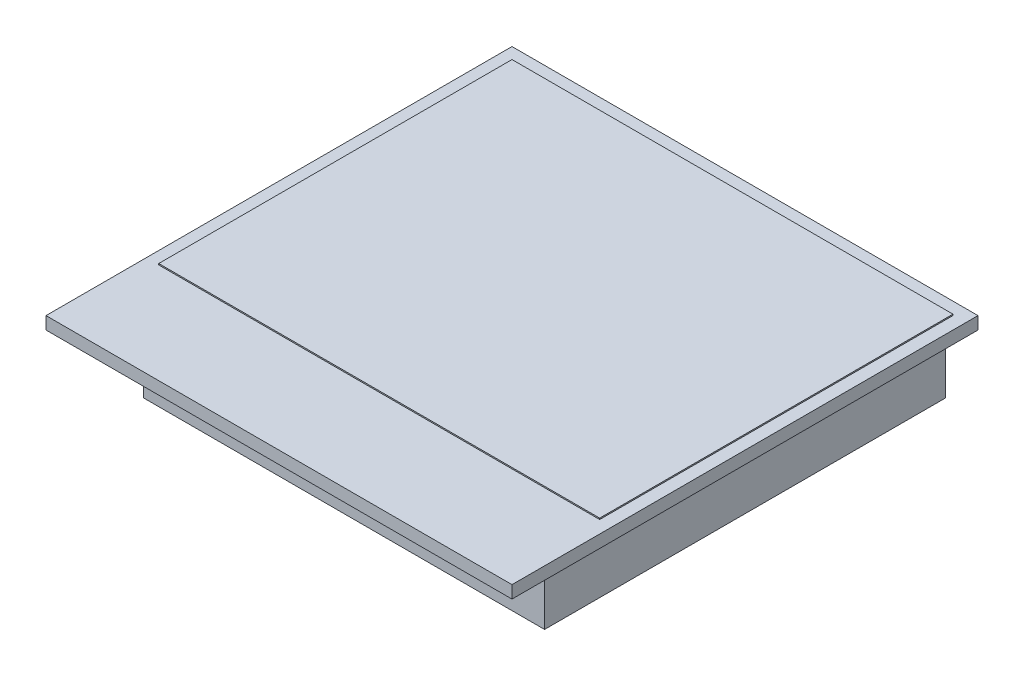
ISO-10303-21;
HEADER;
FILE_DESCRIPTION(('STEP AP214'),'2;1');
FILE_NAME('part.step','',(''),(''),'','','');
FILE_SCHEMA(('AUTOMOTIVE_DESIGN { 1 0 10303 214 1 1 1 1 }'));
ENDSEC;
DATA;
#1=APPLICATION_CONTEXT('core data for automotive mechanical design processes');
#2=APPLICATION_PROTOCOL_DEFINITION('international standard','automotive_design',2000,#1);
#3=PRODUCT_CONTEXT('',#1,'mechanical');
#4=PRODUCT('Part','Part','',(#3));
#5=PRODUCT_RELATED_PRODUCT_CATEGORY('part','',(#4));
#6=PRODUCT_DEFINITION_FORMATION('','',#4);
#7=PRODUCT_DEFINITION_CONTEXT('part definition',#1,'design');
#8=PRODUCT_DEFINITION('design','',#6,#7);
#9=PRODUCT_DEFINITION_SHAPE('','',#8);
#10=(LENGTH_UNIT() NAMED_UNIT(*) SI_UNIT(.MILLI.,.METRE.));
#11=(NAMED_UNIT(*) PLANE_ANGLE_UNIT() SI_UNIT($,.RADIAN.));
#12=(NAMED_UNIT(*) SI_UNIT($,.STERADIAN.) SOLID_ANGLE_UNIT());
#13=UNCERTAINTY_MEASURE_WITH_UNIT(LENGTH_MEASURE(1.E-05),#10,'distance_accuracy_value','');
#14=(GEOMETRIC_REPRESENTATION_CONTEXT(3) GLOBAL_UNCERTAINTY_ASSIGNED_CONTEXT((#13)) GLOBAL_UNIT_ASSIGNED_CONTEXT((#10,
#11,#12)) REPRESENTATION_CONTEXT('',''));
#15=CARTESIAN_POINT('',(0.,0.,0.));
#16=DIRECTION('',(0.,0.,1.));
#17=DIRECTION('',(1.,0.,0.));
#18=AXIS2_PLACEMENT_3D('',#15,#16,#17);
#19=CARTESIAN_POINT('',(-8.,-3.,-2.60000000000001));
#20=DIRECTION('',(1.,0.,0.));
#21=DIRECTION('',(0.,0.,-1.));
#22=AXIS2_PLACEMENT_3D('',#19,#20,#21);
#23=PLANE('',#22);
#24=DIRECTION('',(0.,0.,-1.));
#25=VECTOR('',#24,1.);
#26=CARTESIAN_POINT('',(-8.,0.,-2.60000000000001));
#27=LINE('',#26,#25);
#28=CARTESIAN_POINT('',(-8.,0.,-2.60000000000001));
#29=VERTEX_POINT('',#28);
#30=CARTESIAN_POINT('',(-8.,0.,-18.6));
#31=VERTEX_POINT('',#30);
#32=EDGE_CURVE('E110',#29,#31,#27,.T.);
#33=ORIENTED_EDGE('',*,*,#32,.T.);
#34=DIRECTION('',(0.,1.,0.));
#35=VECTOR('',#34,1.);
#36=CARTESIAN_POINT('',(-8.,-3.,-18.6));
#37=LINE('',#36,#35);
#38=CARTESIAN_POINT('',(-8.,-3.,-18.6));
#39=VERTEX_POINT('',#38);
#40=EDGE_CURVE('E12',#39,#31,#37,.T.);
#41=ORIENTED_EDGE('',*,*,#40,.F.);
#42=DIRECTION('',(0.,0.,-1.));
#43=VECTOR('',#42,1.);
#44=CARTESIAN_POINT('',(-8.,-3.,-2.60000000000001));
#45=LINE('',#44,#43);
#46=CARTESIAN_POINT('',(-8.,-3.,-2.60000000000001));
#47=VERTEX_POINT('',#46);
#48=EDGE_CURVE('E98',#47,#39,#45,.T.);
#49=ORIENTED_EDGE('',*,*,#48,.F.);
#50=DIRECTION('',(0.,1.,0.));
#51=VECTOR('',#50,1.);
#52=CARTESIAN_POINT('',(-8.,-3.,-2.60000000000001));
#53=LINE('',#52,#51);
#54=EDGE_CURVE('E106',#47,#29,#53,.T.);
#55=ORIENTED_EDGE('',*,*,#54,.T.);
#56=EDGE_LOOP('',(#33,#41,#49,#55));
#57=FACE_BOUND('',#56,.T.);
#58=ADVANCED_FACE('F47',(#57),#23,.F.);
#59=CARTESIAN_POINT('',(-8.,-3.,-18.6));
#60=DIRECTION('',(0.,0.,1.));
#61=DIRECTION('',(1.,0.,0.));
#62=AXIS2_PLACEMENT_3D('',#59,#60,#61);
#63=PLANE('',#62);
#64=DIRECTION('',(1.,0.,0.));
#65=VECTOR('',#64,1.);
#66=CARTESIAN_POINT('',(-8.,0.,-18.6));
#67=LINE('',#66,#65);
#68=CARTESIAN_POINT('',(8.,0.,-18.6));
#69=VERTEX_POINT('',#68);
#70=EDGE_CURVE('E102',#31,#69,#67,.T.);
#71=ORIENTED_EDGE('',*,*,#70,.T.);
#72=DIRECTION('',(0.,1.,0.));
#73=VECTOR('',#72,1.);
#74=CARTESIAN_POINT('',(8.,-3.,-18.6));
#75=LINE('',#74,#73);
#76=CARTESIAN_POINT('',(8.,-3.,-18.6));
#77=VERTEX_POINT('',#76);
#78=EDGE_CURVE('E55',#77,#69,#75,.T.);
#79=ORIENTED_EDGE('',*,*,#78,.F.);
#80=DIRECTION('',(1.,0.,0.));
#81=VECTOR('',#80,1.);
#82=CARTESIAN_POINT('',(-8.,-3.,-18.6));
#83=LINE('',#82,#81);
#84=EDGE_CURVE('E93',#39,#77,#83,.T.);
#85=ORIENTED_EDGE('',*,*,#84,.F.);
#86=ORIENTED_EDGE('',*,*,#40,.T.);
#87=EDGE_LOOP('',(#71,#79,#85,#86));
#88=FACE_BOUND('',#87,.T.);
#89=ADVANCED_FACE('F101',(#88),#63,.F.);
#90=CARTESIAN_POINT('',(8.,-3.,-2.60000000000001));
#91=DIRECTION('',(-1.,0.,0.));
#92=DIRECTION('',(0.,0.,1.));
#93=AXIS2_PLACEMENT_3D('',#90,#91,#92);
#94=PLANE('',#93);
#95=DIRECTION('',(0.,0.,1.));
#96=VECTOR('',#95,1.);
#97=CARTESIAN_POINT('',(8.,0.,-2.60000000000001));
#98=LINE('',#97,#96);
#99=CARTESIAN_POINT('',(8.,0.,-2.60000000000001));
#100=VERTEX_POINT('',#99);
#101=EDGE_CURVE('E80',#69,#100,#98,.T.);
#102=ORIENTED_EDGE('',*,*,#101,.T.);
#103=DIRECTION('',(0.,1.,0.));
#104=VECTOR('',#103,1.);
#105=CARTESIAN_POINT('',(8.,-3.,-2.60000000000001));
#106=LINE('',#105,#104);
#107=CARTESIAN_POINT('',(8.,-3.,-2.60000000000001));
#108=VERTEX_POINT('',#107);
#109=EDGE_CURVE('E103',#108,#100,#106,.T.);
#110=ORIENTED_EDGE('',*,*,#109,.F.);
#111=DIRECTION('',(0.,0.,1.));
#112=VECTOR('',#111,1.);
#113=CARTESIAN_POINT('',(8.,-3.,-2.60000000000001));
#114=LINE('',#113,#112);
#115=EDGE_CURVE('E96',#77,#108,#114,.T.);
#116=ORIENTED_EDGE('',*,*,#115,.F.);
#117=ORIENTED_EDGE('',*,*,#78,.T.);
#118=EDGE_LOOP('',(#102,#110,#116,#117));
#119=FACE_BOUND('',#118,.T.);
#120=ADVANCED_FACE('F104',(#119),#94,.F.);
#121=CARTESIAN_POINT('',(-8.,-3.,-2.60000000000001));
#122=DIRECTION('',(0.,0.,-1.));
#123=DIRECTION('',(-1.,0.,0.));
#124=AXIS2_PLACEMENT_3D('',#121,#122,#123);
#125=PLANE('',#124);
#126=DIRECTION('',(-1.,0.,0.));
#127=VECTOR('',#126,1.);
#128=CARTESIAN_POINT('',(-8.,0.,-2.60000000000001));
#129=LINE('',#128,#127);
#130=EDGE_CURVE('E86',#100,#29,#129,.T.);
#131=ORIENTED_EDGE('',*,*,#130,.T.);
#132=ORIENTED_EDGE('',*,*,#54,.F.);
#133=DIRECTION('',(-1.,0.,0.));
#134=VECTOR('',#133,1.);
#135=CARTESIAN_POINT('',(-8.,-3.,-2.60000000000001));
#136=LINE('',#135,#134);
#137=EDGE_CURVE('E63',#108,#47,#136,.T.);
#138=ORIENTED_EDGE('',*,*,#137,.F.);
#139=ORIENTED_EDGE('',*,*,#109,.T.);
#140=EDGE_LOOP('',(#131,#132,#138,#139));
#141=FACE_BOUND('',#140,.T.);
#142=ADVANCED_FACE('F117',(#141),#125,.F.);
#143=CARTESIAN_POINT('',(0.,-3.,0.));
#144=DIRECTION('',(0.,-1.,0.));
#145=DIRECTION('',(0.,0.,-1.));
#146=AXIS2_PLACEMENT_3D('',#143,#144,#145);
#147=PLANE('',#146);
#148=ORIENTED_EDGE('',*,*,#48,.T.);
#149=ORIENTED_EDGE('',*,*,#84,.T.);
#150=ORIENTED_EDGE('',*,*,#115,.T.);
#151=ORIENTED_EDGE('',*,*,#137,.T.);
#152=EDGE_LOOP('',(#148,#149,#150,#151));
#153=FACE_BOUND('',#152,.T.);
#154=ADVANCED_FACE('F94',(#153),#147,.T.);
#155=CARTESIAN_POINT('',(0.,0.,0.));
#156=DIRECTION('',(0.,-1.,0.));
#157=DIRECTION('',(0.,0.,-1.));
#158=AXIS2_PLACEMENT_3D('',#155,#156,#157);
#159=PLANE('',#158);
#160=ORIENTED_EDGE('',*,*,#32,.F.);
#161=ORIENTED_EDGE('',*,*,#130,.F.);
#162=ORIENTED_EDGE('',*,*,#101,.F.);
#163=ORIENTED_EDGE('',*,*,#70,.F.);
#164=EDGE_LOOP('',(#160,#161,#162,#163));
#165=FACE_BOUND('',#164,.T.);
#166=ADVANCED_FACE('F120',(#165),#159,.F.);
#167=CLOSED_SHELL('',(#58,#89,#120,#142,#154,#166));
#168=MANIFOLD_SOLID_BREP('B2',#167);
#169=CARTESIAN_POINT('',(-8.8,0.55,-18.1));
#170=DIRECTION('',(1.,0.,0.));
#171=DIRECTION('',(0.,0.,-1.));
#172=AXIS2_PLACEMENT_3D('',#169,#170,#171);
#173=PLANE('',#172);
#174=DIRECTION('',(0.,0.,1.));
#175=VECTOR('',#174,1.);
#176=CARTESIAN_POINT('',(-8.8,0.5,-18.1));
#177=LINE('',#176,#175);
#178=CARTESIAN_POINT('',(-8.8,0.5,-18.1));
#179=VERTEX_POINT('',#178);
#180=CARTESIAN_POINT('',(-8.8,0.5,-4.));
#181=VERTEX_POINT('',#180);
#182=EDGE_CURVE('E242',#179,#181,#177,.T.);
#183=ORIENTED_EDGE('',*,*,#182,.T.);
#184=DIRECTION('',(0.,-1.,0.));
#185=VECTOR('',#184,1.);
#186=CARTESIAN_POINT('',(-8.8,0.55,-4.));
#187=LINE('',#186,#185);
#188=CARTESIAN_POINT('',(-8.8,0.55,-4.));
#189=VERTEX_POINT('',#188);
#190=EDGE_CURVE('E45',#189,#181,#187,.T.);
#191=ORIENTED_EDGE('',*,*,#190,.F.);
#192=DIRECTION('',(0.,0.,1.));
#193=VECTOR('',#192,1.);
#194=CARTESIAN_POINT('',(-8.8,0.55,-18.1));
#195=LINE('',#194,#193);
#196=CARTESIAN_POINT('',(-8.8,0.55,-18.1));
#197=VERTEX_POINT('',#196);
#198=EDGE_CURVE('E230',#197,#189,#195,.T.);
#199=ORIENTED_EDGE('',*,*,#198,.F.);
#200=DIRECTION('',(0.,-1.,0.));
#201=VECTOR('',#200,1.);
#202=CARTESIAN_POINT('',(-8.8,0.55,-18.1));
#203=LINE('',#202,#201);
#204=EDGE_CURVE('E238',#197,#179,#203,.T.);
#205=ORIENTED_EDGE('',*,*,#204,.T.);
#206=EDGE_LOOP('',(#183,#191,#199,#205));
#207=FACE_BOUND('',#206,.T.);
#208=ADVANCED_FACE('F179',(#207),#173,.F.);
#209=CARTESIAN_POINT('',(-8.8,0.55,-4.));
#210=DIRECTION('',(0.,0.,-1.));
#211=DIRECTION('',(-1.,0.,0.));
#212=AXIS2_PLACEMENT_3D('',#209,#210,#211);
#213=PLANE('',#212);
#214=DIRECTION('',(1.,0.,0.));
#215=VECTOR('',#214,1.);
#216=CARTESIAN_POINT('',(-8.8,0.5,-4.));
#217=LINE('',#216,#215);
#218=CARTESIAN_POINT('',(8.8,0.5,-4.));
#219=VERTEX_POINT('',#218);
#220=EDGE_CURVE('E234',#181,#219,#217,.T.);
#221=ORIENTED_EDGE('',*,*,#220,.T.);
#222=DIRECTION('',(0.,-1.,0.));
#223=VECTOR('',#222,1.);
#224=CARTESIAN_POINT('',(8.8,0.55,-4.));
#225=LINE('',#224,#223);
#226=CARTESIAN_POINT('',(8.8,0.55,-4.));
#227=VERTEX_POINT('',#226);
#228=EDGE_CURVE('E187',#227,#219,#225,.T.);
#229=ORIENTED_EDGE('',*,*,#228,.F.);
#230=DIRECTION('',(1.,0.,0.));
#231=VECTOR('',#230,1.);
#232=CARTESIAN_POINT('',(-8.8,0.55,-4.));
#233=LINE('',#232,#231);
#234=EDGE_CURVE('E225',#189,#227,#233,.T.);
#235=ORIENTED_EDGE('',*,*,#234,.F.);
#236=ORIENTED_EDGE('',*,*,#190,.T.);
#237=EDGE_LOOP('',(#221,#229,#235,#236));
#238=FACE_BOUND('',#237,.T.);
#239=ADVANCED_FACE('F233',(#238),#213,.F.);
#240=CARTESIAN_POINT('',(8.8,0.55,-18.1));
#241=DIRECTION('',(-1.,0.,0.));
#242=DIRECTION('',(0.,0.,1.));
#243=AXIS2_PLACEMENT_3D('',#240,#241,#242);
#244=PLANE('',#243);
#245=DIRECTION('',(0.,0.,-1.));
#246=VECTOR('',#245,1.);
#247=CARTESIAN_POINT('',(8.8,0.5,-18.1));
#248=LINE('',#247,#246);
#249=CARTESIAN_POINT('',(8.8,0.5,-18.1));
#250=VERTEX_POINT('',#249);
#251=EDGE_CURVE('E212',#219,#250,#248,.T.);
#252=ORIENTED_EDGE('',*,*,#251,.T.);
#253=DIRECTION('',(0.,-1.,0.));
#254=VECTOR('',#253,1.);
#255=CARTESIAN_POINT('',(8.8,0.55,-18.1));
#256=LINE('',#255,#254);
#257=CARTESIAN_POINT('',(8.8,0.55,-18.1));
#258=VERTEX_POINT('',#257);
#259=EDGE_CURVE('E235',#258,#250,#256,.T.);
#260=ORIENTED_EDGE('',*,*,#259,.F.);
#261=DIRECTION('',(0.,0.,-1.));
#262=VECTOR('',#261,1.);
#263=CARTESIAN_POINT('',(8.8,0.55,-18.1));
#264=LINE('',#263,#262);
#265=EDGE_CURVE('E228',#227,#258,#264,.T.);
#266=ORIENTED_EDGE('',*,*,#265,.F.);
#267=ORIENTED_EDGE('',*,*,#228,.T.);
#268=EDGE_LOOP('',(#252,#260,#266,#267));
#269=FACE_BOUND('',#268,.T.);
#270=ADVANCED_FACE('F236',(#269),#244,.F.);
#271=CARTESIAN_POINT('',(-8.8,0.55,-18.1));
#272=DIRECTION('',(0.,0.,1.));
#273=DIRECTION('',(1.,0.,0.));
#274=AXIS2_PLACEMENT_3D('',#271,#272,#273);
#275=PLANE('',#274);
#276=DIRECTION('',(-1.,0.,0.));
#277=VECTOR('',#276,1.);
#278=CARTESIAN_POINT('',(-8.8,0.5,-18.1));
#279=LINE('',#278,#277);
#280=EDGE_CURVE('E218',#250,#179,#279,.T.);
#281=ORIENTED_EDGE('',*,*,#280,.T.);
#282=ORIENTED_EDGE('',*,*,#204,.F.);
#283=DIRECTION('',(-1.,0.,0.));
#284=VECTOR('',#283,1.);
#285=CARTESIAN_POINT('',(-8.8,0.55,-18.1));
#286=LINE('',#285,#284);
#287=EDGE_CURVE('E195',#258,#197,#286,.T.);
#288=ORIENTED_EDGE('',*,*,#287,.F.);
#289=ORIENTED_EDGE('',*,*,#259,.T.);
#290=EDGE_LOOP('',(#281,#282,#288,#289));
#291=FACE_BOUND('',#290,.T.);
#292=ADVANCED_FACE('F249',(#291),#275,.F.);
#293=CARTESIAN_POINT('',(0.,0.55,0.));
#294=DIRECTION('',(0.,1.,0.));
#295=DIRECTION('',(0.,0.,1.));
#296=AXIS2_PLACEMENT_3D('',#293,#294,#295);
#297=PLANE('',#296);
#298=ORIENTED_EDGE('',*,*,#198,.T.);
#299=ORIENTED_EDGE('',*,*,#234,.T.);
#300=ORIENTED_EDGE('',*,*,#265,.T.);
#301=ORIENTED_EDGE('',*,*,#287,.T.);
#302=EDGE_LOOP('',(#298,#299,#300,#301));
#303=FACE_BOUND('',#302,.T.);
#304=ADVANCED_FACE('F226',(#303),#297,.T.);
#305=CARTESIAN_POINT('',(0.,0.5,0.));
#306=DIRECTION('',(0.,1.,0.));
#307=DIRECTION('',(0.,0.,1.));
#308=AXIS2_PLACEMENT_3D('',#305,#306,#307);
#309=PLANE('',#308);
#310=ORIENTED_EDGE('',*,*,#182,.F.);
#311=ORIENTED_EDGE('',*,*,#280,.F.);
#312=ORIENTED_EDGE('',*,*,#251,.F.);
#313=ORIENTED_EDGE('',*,*,#220,.F.);
#314=EDGE_LOOP('',(#310,#311,#312,#313));
#315=FACE_BOUND('',#314,.T.);
#316=ADVANCED_FACE('F252',(#315),#309,.F.);
#317=CLOSED_SHELL('',(#208,#239,#270,#292,#304,#316));
#318=MANIFOLD_SOLID_BREP('B6',#317);
#319=CARTESIAN_POINT('',(-9.3,0.5,0.));
#320=DIRECTION('',(1.,0.,0.));
#321=DIRECTION('',(0.,0.,-1.));
#322=AXIS2_PLACEMENT_3D('',#319,#320,#321);
#323=PLANE('',#322);
#324=DIRECTION('',(0.,0.,1.));
#325=VECTOR('',#324,1.);
#326=CARTESIAN_POINT('',(-9.3,0.,0.));
#327=LINE('',#326,#325);
#328=CARTESIAN_POINT('',(-9.3,0.,-18.6));
#329=VERTEX_POINT('',#328);
#330=CARTESIAN_POINT('',(-9.3,0.,0.));
#331=VERTEX_POINT('',#330);
#332=EDGE_CURVE('E365',#329,#331,#327,.T.);
#333=ORIENTED_EDGE('',*,*,#332,.T.);
#334=DIRECTION('',(0.,-1.,0.));
#335=VECTOR('',#334,1.);
#336=CARTESIAN_POINT('',(-9.3,0.5,0.));
#337=LINE('',#336,#335);
#338=CARTESIAN_POINT('',(-9.3,0.5,0.));
#339=VERTEX_POINT('',#338);
#340=EDGE_CURVE('E177',#339,#331,#337,.T.);
#341=ORIENTED_EDGE('',*,*,#340,.F.);
#342=DIRECTION('',(0.,0.,1.));
#343=VECTOR('',#342,1.);
#344=CARTESIAN_POINT('',(-9.3,0.5,0.));
#345=LINE('',#344,#343);
#346=CARTESIAN_POINT('',(-9.3,0.5,-18.6));
#347=VERTEX_POINT('',#346);
#348=EDGE_CURVE('E353',#347,#339,#345,.T.);
#349=ORIENTED_EDGE('',*,*,#348,.F.);
#350=DIRECTION('',(0.,-1.,0.));
#351=VECTOR('',#350,1.);
#352=CARTESIAN_POINT('',(-9.3,0.5,-18.6));
#353=LINE('',#352,#351);
#354=EDGE_CURVE('E361',#347,#329,#353,.T.);
#355=ORIENTED_EDGE('',*,*,#354,.T.);
#356=EDGE_LOOP('',(#333,#341,#349,#355));
#357=FACE_BOUND('',#356,.T.);
#358=ADVANCED_FACE('F302',(#357),#323,.F.);
#359=CARTESIAN_POINT('',(-9.3,0.5,0.));
#360=DIRECTION('',(0.,0.,-1.));
#361=DIRECTION('',(-1.,0.,0.));
#362=AXIS2_PLACEMENT_3D('',#359,#360,#361);
#363=PLANE('',#362);
#364=DIRECTION('',(1.,0.,0.));
#365=VECTOR('',#364,1.);
#366=CARTESIAN_POINT('',(-9.3,0.,0.));
#367=LINE('',#366,#365);
#368=CARTESIAN_POINT('',(9.3,0.,0.));
#369=VERTEX_POINT('',#368);
#370=EDGE_CURVE('E357',#331,#369,#367,.T.);
#371=ORIENTED_EDGE('',*,*,#370,.T.);
#372=DIRECTION('',(0.,-1.,0.));
#373=VECTOR('',#372,1.);
#374=CARTESIAN_POINT('',(9.3,0.5,0.));
#375=LINE('',#374,#373);
#376=CARTESIAN_POINT('',(9.3,0.5,0.));
#377=VERTEX_POINT('',#376);
#378=EDGE_CURVE('E310',#377,#369,#375,.T.);
#379=ORIENTED_EDGE('',*,*,#378,.F.);
#380=DIRECTION('',(1.,0.,0.));
#381=VECTOR('',#380,1.);
#382=CARTESIAN_POINT('',(-9.3,0.5,0.));
#383=LINE('',#382,#381);
#384=EDGE_CURVE('E348',#339,#377,#383,.T.);
#385=ORIENTED_EDGE('',*,*,#384,.F.);
#386=ORIENTED_EDGE('',*,*,#340,.T.);
#387=EDGE_LOOP('',(#371,#379,#385,#386));
#388=FACE_BOUND('',#387,.T.);
#389=ADVANCED_FACE('F356',(#388),#363,.F.);
#390=CARTESIAN_POINT('',(9.3,0.5,0.));
#391=DIRECTION('',(-1.,0.,0.));
#392=DIRECTION('',(0.,0.,1.));
#393=AXIS2_PLACEMENT_3D('',#390,#391,#392);
#394=PLANE('',#393);
#395=DIRECTION('',(0.,0.,-1.));
#396=VECTOR('',#395,1.);
#397=CARTESIAN_POINT('',(9.3,0.,0.));
#398=LINE('',#397,#396);
#399=CARTESIAN_POINT('',(9.29999999999999,0.,-18.6));
#400=VERTEX_POINT('',#399);
#401=EDGE_CURVE('E335',#369,#400,#398,.T.);
#402=ORIENTED_EDGE('',*,*,#401,.T.);
#403=DIRECTION('',(0.,-1.,0.));
#404=VECTOR('',#403,1.);
#405=CARTESIAN_POINT('',(9.29999999999999,0.5,-18.6));
#406=LINE('',#405,#404);
#407=CARTESIAN_POINT('',(9.29999999999999,0.5,-18.6));
#408=VERTEX_POINT('',#407);
#409=EDGE_CURVE('E358',#408,#400,#406,.T.);
#410=ORIENTED_EDGE('',*,*,#409,.F.);
#411=DIRECTION('',(0.,0.,-1.));
#412=VECTOR('',#411,1.);
#413=CARTESIAN_POINT('',(9.3,0.5,0.));
#414=LINE('',#413,#412);
#415=EDGE_CURVE('E351',#377,#408,#414,.T.);
#416=ORIENTED_EDGE('',*,*,#415,.F.);
#417=ORIENTED_EDGE('',*,*,#378,.T.);
#418=EDGE_LOOP('',(#402,#410,#416,#417));
#419=FACE_BOUND('',#418,.T.);
#420=ADVANCED_FACE('F359',(#419),#394,.F.);
#421=CARTESIAN_POINT('',(-9.3,0.5,-18.6));
#422=DIRECTION('',(0.,0.,1.));
#423=DIRECTION('',(1.,0.,0.));
#424=AXIS2_PLACEMENT_3D('',#421,#422,#423);
#425=PLANE('',#424);
#426=DIRECTION('',(-1.,0.,0.));
#427=VECTOR('',#426,1.);
#428=CARTESIAN_POINT('',(-9.3,0.,-18.6));
#429=LINE('',#428,#427);
#430=EDGE_CURVE('E341',#400,#329,#429,.T.);
#431=ORIENTED_EDGE('',*,*,#430,.T.);
#432=ORIENTED_EDGE('',*,*,#354,.F.);
#433=DIRECTION('',(-1.,0.,0.));
#434=VECTOR('',#433,1.);
#435=CARTESIAN_POINT('',(-9.3,0.5,-18.6));
#436=LINE('',#435,#434);
#437=EDGE_CURVE('E318',#408,#347,#436,.T.);
#438=ORIENTED_EDGE('',*,*,#437,.F.);
#439=ORIENTED_EDGE('',*,*,#409,.T.);
#440=EDGE_LOOP('',(#431,#432,#438,#439));
#441=FACE_BOUND('',#440,.T.);
#442=ADVANCED_FACE('F372',(#441),#425,.F.);
#443=CARTESIAN_POINT('',(0.,0.5,0.));
#444=DIRECTION('',(0.,-1.,0.));
#445=DIRECTION('',(0.,0.,-1.));
#446=AXIS2_PLACEMENT_3D('',#443,#444,#445);
#447=PLANE('',#446);
#448=ORIENTED_EDGE('',*,*,#348,.T.);
#449=ORIENTED_EDGE('',*,*,#384,.T.);
#450=ORIENTED_EDGE('',*,*,#415,.T.);
#451=ORIENTED_EDGE('',*,*,#437,.T.);
#452=EDGE_LOOP('',(#448,#449,#450,#451));
#453=FACE_BOUND('',#452,.T.);
#454=ADVANCED_FACE('F349',(#453),#447,.F.);
#455=CARTESIAN_POINT('',(0.,0.,0.));
#456=DIRECTION('',(0.,-1.,0.));
#457=DIRECTION('',(0.,0.,-1.));
#458=AXIS2_PLACEMENT_3D('',#455,#456,#457);
#459=PLANE('',#458);
#460=ORIENTED_EDGE('',*,*,#332,.F.);
#461=ORIENTED_EDGE('',*,*,#430,.F.);
#462=ORIENTED_EDGE('',*,*,#401,.F.);
#463=ORIENTED_EDGE('',*,*,#370,.F.);
#464=EDGE_LOOP('',(#460,#461,#462,#463));
#465=FACE_BOUND('',#464,.T.);
#466=ADVANCED_FACE('F375',(#465),#459,.T.);
#467=CLOSED_SHELL('',(#358,#389,#420,#442,#454,#466));
#468=MANIFOLD_SOLID_BREP('B39',#467);
#469=ADVANCED_BREP_SHAPE_REPRESENTATION('',(#18,#168,#318,#468),#14);
#470=SHAPE_DEFINITION_REPRESENTATION(#9,#469);
ENDSEC;
END-ISO-10303-21;
